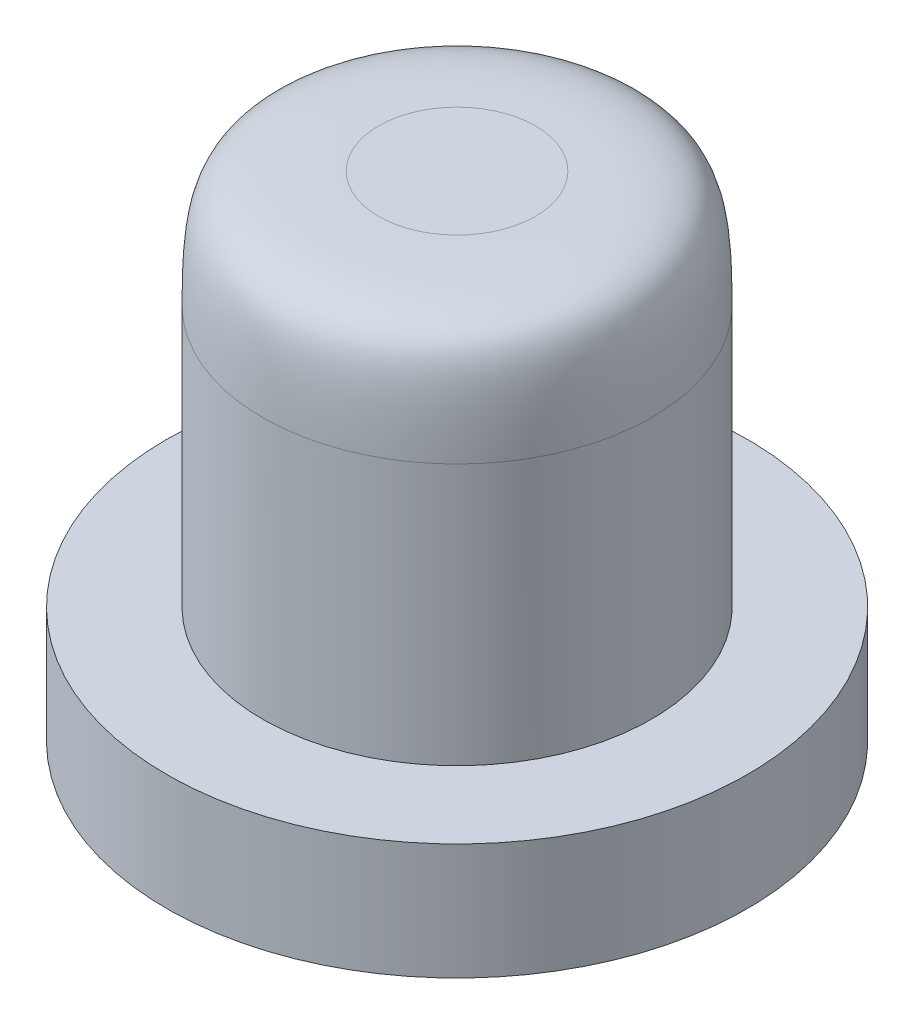
ISO-10303-21;
HEADER;
FILE_DESCRIPTION(('STEP AP214'),'2;1');
FILE_NAME('part.step','',(''),(''),'','','');
FILE_SCHEMA(('AUTOMOTIVE_DESIGN { 1 0 10303 214 1 1 1 1 }'));
ENDSEC;
DATA;
#1=APPLICATION_CONTEXT('core data for automotive mechanical design processes');
#2=APPLICATION_PROTOCOL_DEFINITION('international standard','automotive_design',2000,#1);
#3=PRODUCT_CONTEXT('',#1,'mechanical');
#4=PRODUCT('Part','Part','',(#3));
#5=PRODUCT_RELATED_PRODUCT_CATEGORY('part','',(#4));
#6=PRODUCT_DEFINITION_FORMATION('','',#4);
#7=PRODUCT_DEFINITION_CONTEXT('part definition',#1,'design');
#8=PRODUCT_DEFINITION('design','',#6,#7);
#9=PRODUCT_DEFINITION_SHAPE('','',#8);
#10=(LENGTH_UNIT() NAMED_UNIT(*) SI_UNIT(.MILLI.,.METRE.));
#11=(NAMED_UNIT(*) PLANE_ANGLE_UNIT() SI_UNIT($,.RADIAN.));
#12=(NAMED_UNIT(*) SI_UNIT($,.STERADIAN.) SOLID_ANGLE_UNIT());
#13=UNCERTAINTY_MEASURE_WITH_UNIT(LENGTH_MEASURE(1.E-05),#10,'distance_accuracy_value','');
#14=(GEOMETRIC_REPRESENTATION_CONTEXT(3) GLOBAL_UNCERTAINTY_ASSIGNED_CONTEXT((#13)) GLOBAL_UNIT_ASSIGNED_CONTEXT((#10,
#11,#12)) REPRESENTATION_CONTEXT('',''));
#15=CARTESIAN_POINT('',(0.,0.,0.));
#16=DIRECTION('',(0.,0.,1.));
#17=DIRECTION('',(1.,0.,0.));
#18=AXIS2_PLACEMENT_3D('',#15,#16,#17);
#19=CARTESIAN_POINT('',(0.,0.,0.));
#20=DIRECTION('',(0.,1.,0.));
#21=DIRECTION('',(-1.,0.,0.));
#22=AXIS2_PLACEMENT_3D('',#19,#20,#21);
#23=PLANE('',#22);
#24=CARTESIAN_POINT('',(0.,0.,0.));
#25=DIRECTION('',(0.,1.,0.));
#26=DIRECTION('',(-1.,0.,0.));
#27=AXIS2_PLACEMENT_3D('',#24,#25,#26);
#28=CIRCLE('',#27,5.);
#29=CARTESIAN_POINT('',(-5.,0.,0.));
#30=VERTEX_POINT('',#29);
#31=EDGE_CURVE('E53',#30,#30,#28,.T.);
#32=ORIENTED_EDGE('',*,*,#31,.F.);
#33=EDGE_LOOP('',(#32));
#34=FACE_BOUND('',#33,.T.);
#35=ADVANCED_FACE('F35',(#34),#23,.F.);
#36=CARTESIAN_POINT('',(0.,8.5,0.));
#37=DIRECTION('',(0.,1.,0.));
#38=DIRECTION('',(-1.,0.,0.));
#39=AXIS2_PLACEMENT_3D('',#36,#37,#38);
#40=CYLINDRICAL_SURFACE('',#39,5.);
#41=CARTESIAN_POINT('',(0.,2.,0.));
#42=DIRECTION('',(0.,1.,0.));
#43=DIRECTION('',(-1.,0.,0.));
#44=AXIS2_PLACEMENT_3D('',#41,#42,#43);
#45=CIRCLE('',#44,5.);
#46=CARTESIAN_POINT('',(-5.,2.,0.));
#47=VERTEX_POINT('',#46);
#48=EDGE_CURVE('E58',#47,#47,#45,.T.);
#49=ORIENTED_EDGE('',*,*,#48,.F.);
#50=EDGE_LOOP('',(#49));
#51=FACE_BOUND('',#50,.T.);
#52=ORIENTED_EDGE('',*,*,#31,.T.);
#53=EDGE_LOOP('',(#52));
#54=FACE_BOUND('',#53,.T.);
#55=ADVANCED_FACE('F108',(#51,#54),#40,.T.);
#56=CARTESIAN_POINT('',(5.,2.,0.));
#57=DIRECTION('',(0.,-1.,0.));
#58=DIRECTION('',(1.,0.,0.));
#59=AXIS2_PLACEMENT_3D('',#56,#57,#58);
#60=PLANE('',#59);
#61=CARTESIAN_POINT('',(0.,2.,0.));
#62=DIRECTION('',(0.,1.,0.));
#63=DIRECTION('',(-1.,0.,0.));
#64=AXIS2_PLACEMENT_3D('',#61,#62,#63);
#65=CIRCLE('',#64,3.35);
#66=CARTESIAN_POINT('',(-3.35,2.,0.));
#67=VERTEX_POINT('',#66);
#68=EDGE_CURVE('E63',#67,#67,#65,.T.);
#69=ORIENTED_EDGE('',*,*,#68,.F.);
#70=EDGE_LOOP('',(#69));
#71=FACE_BOUND('',#70,.T.);
#72=ORIENTED_EDGE('',*,*,#48,.T.);
#73=EDGE_LOOP('',(#72));
#74=FACE_BOUND('',#73,.T.);
#75=ADVANCED_FACE('F84',(#71,#74),#60,.F.);
#76=CARTESIAN_POINT('',(0.,8.5,0.));
#77=DIRECTION('',(0.,1.,0.));
#78=DIRECTION('',(-1.,0.,0.));
#79=AXIS2_PLACEMENT_3D('',#76,#77,#78);
#80=CYLINDRICAL_SURFACE('',#79,3.35);
#81=CARTESIAN_POINT('',(-3.35,6.5,0.));
#82=CARTESIAN_POINT('',(-3.35,6.5,0.438513934461704));
#83=CARTESIAN_POINT('',(-3.26280845149254,6.5,0.876855449652885));
#84=CARTESIAN_POINT('',(-2.92718441633308,6.5,1.68712354719323));
#85=CARTESIAN_POINT('',(-2.67888389367756,6.5,2.05873154027231));
#86=CARTESIAN_POINT('',(-2.05873154027231,6.5,2.67888389367756));
#87=CARTESIAN_POINT('',(-1.68712354719323,6.5,2.92718441633308));
#88=CARTESIAN_POINT('',(-0.876855449652879,6.5,3.26280845149254));
#89=CARTESIAN_POINT('',(-0.438513934461704,6.5,3.35));
#90=CARTESIAN_POINT('',(0.438513934461704,6.5,3.35));
#91=CARTESIAN_POINT('',(0.876855449652876,6.5,3.26280845149254));
#92=CARTESIAN_POINT('',(1.68712354719322,6.5,2.92718441633308));
#93=CARTESIAN_POINT('',(2.05873154027227,6.5,2.6788838936776));
#94=CARTESIAN_POINT('',(2.6788838936776,6.5,2.05873154027227));
#95=CARTESIAN_POINT('',(2.92718441633309,6.5,1.68712354719319));
#96=CARTESIAN_POINT('',(3.26280845149253,6.5,0.876855449652908));
#97=CARTESIAN_POINT('',(3.35,6.5,0.438513934461899));
#98=CARTESIAN_POINT('',(3.35,6.5,-0.438513934461899));
#99=CARTESIAN_POINT('',(3.26280845149252,6.5,-0.876855449652927));
#100=CARTESIAN_POINT('',(2.9271844163331,6.5,-1.68712354719317));
#101=CARTESIAN_POINT('',(2.67888389367764,6.5,-2.05873154027223));
#102=CARTESIAN_POINT('',(2.05873154027223,6.5,-2.67888389367763));
#103=CARTESIAN_POINT('',(1.68712354719298,6.5,-2.92718441633318));
#104=CARTESIAN_POINT('',(0.876855449653121,6.5,-3.26280845149244));
#105=CARTESIAN_POINT('',(0.438513934461706,6.5,-3.35));
#106=CARTESIAN_POINT('',(-0.438513934461702,6.5,-3.35));
#107=CARTESIAN_POINT('',(-0.876855449652902,6.5,-3.26280845149253));
#108=CARTESIAN_POINT('',(-1.68712354719321,6.5,-2.92718441633309));
#109=CARTESIAN_POINT('',(-2.05873154027225,6.5,-2.67888389367762));
#110=CARTESIAN_POINT('',(-2.67888389367761,6.5,-2.05873154027225));
#111=CARTESIAN_POINT('',(-2.9271844163331,6.5,-1.68712354719319));
#112=CARTESIAN_POINT('',(-3.26280845149253,6.5,-0.876855449652906));
#113=CARTESIAN_POINT('',(-3.35,6.5,-0.438513934461704));
#114=CARTESIAN_POINT('',(-3.35,6.5,0.));
#115=(BOUNDED_CURVE() B_SPLINE_CURVE(3,(#81,#82,#83,#84,#85,#86,#87,#88,#89,#90,#91,#92,#93,#94,
#95,#96,#97,#98,#99,#100,#101,#102,#103,#104,#105,#106,#107,#108,#109,#110,#111,#112,#113,#114),
.UNSPECIFIED.,.T.,.F.) B_SPLINE_CURVE_WITH_KNOTS((4,2,2,2,2,2,2,2,2,2,2,2,2,2,2,2,4),
(-3.14159265358979,-2.74889357189107,-2.35619449019234,-1.96349540849362,-1.5707963267949,
-1.17809724509617,-0.785398163397448,-0.392699081698724,0.,0.392699081698724,0.785398163397448,
1.17809724509617,1.5707963267949,1.96349540849362,2.35619449019234,2.74889357189107,
3.14159265358979),
.UNSPECIFIED.) CURVE() GEOMETRIC_REPRESENTATION_ITEM() RATIONAL_B_SPLINE_CURVE((1.,1.,1.,1.,1.,
1.,1.,1.,1.,1.,1.,1.,1.,1.,1.,1.,1.,1.,1.,1.,1.,1.,1.,1.,1.,1.,1.,1.,1.,1.,1.,1.,1.,1.)) REPRESENTATION_ITEM(''));
#116=CARTESIAN_POINT('',(-3.35,6.5,0.));
#117=VERTEX_POINT('',#116);
#118=EDGE_CURVE('E11',#117,#117,#115,.F.);
#119=ORIENTED_EDGE('',*,*,#118,.T.);
#120=EDGE_LOOP('',(#119));
#121=FACE_BOUND('',#120,.T.);
#122=ORIENTED_EDGE('',*,*,#68,.T.);
#123=EDGE_LOOP('',(#122));
#124=FACE_BOUND('',#123,.T.);
#125=ADVANCED_FACE('F80',(#121,#124),#80,.T.);
#126=CARTESIAN_POINT('',(3.35,8.5,0.));
#127=DIRECTION('',(0.,-1.,0.));
#128=DIRECTION('',(1.,0.,0.));
#129=AXIS2_PLACEMENT_3D('',#126,#127,#128);
#130=PLANE('',#129);
#131=CARTESIAN_POINT('',(-1.35,8.5,0.));
#132=CARTESIAN_POINT('',(-1.35,8.5,-0.17671457060397));
#133=CARTESIAN_POINT('',(-1.3148631073179,8.5,-0.353359658815345));
#134=CARTESIAN_POINT('',(-1.17961163046258,8.5,-0.679885608570394));
#135=CARTESIAN_POINT('',(-1.07955022581039,8.5,-0.829638083393303));
#136=CARTESIAN_POINT('',(-0.829638083393293,8.5,-1.07955022581038));
#137=CARTESIAN_POINT('',(-0.679885608570398,8.5,-1.17961163046258));
#138=CARTESIAN_POINT('',(-0.353359658815349,8.5,-1.31486310731789));
#139=CARTESIAN_POINT('',(-0.17671457060397,8.5,-1.35));
#140=CARTESIAN_POINT('',(0.176714570603971,8.5,-1.35));
#141=CARTESIAN_POINT('',(0.353359658815442,8.5,-1.31486310731786));
#142=CARTESIAN_POINT('',(0.6798856085703,8.5,-1.17961163046262));
#143=CARTESIAN_POINT('',(0.829638083393293,8.5,-1.07955022581038));
#144=CARTESIAN_POINT('',(1.07955022581039,8.5,-0.829638083393292));
#145=CARTESIAN_POINT('',(1.17961163046259,8.5,-0.679885608570383));
#146=CARTESIAN_POINT('',(1.31486310731789,8.5,-0.353359658815359));
#147=CARTESIAN_POINT('',(1.35,8.5,-0.176714570604049));
#148=CARTESIAN_POINT('',(1.35,8.5,0.176714570604049));
#149=CARTESIAN_POINT('',(1.31486310731789,8.5,0.35335965881534));
#150=CARTESIAN_POINT('',(1.17961163046258,8.5,0.679885608570403));
#151=CARTESIAN_POINT('',(1.07955022581037,8.5,0.829638083393302));
#152=CARTESIAN_POINT('',(0.829638083393312,8.5,1.07955022581038));
#153=CARTESIAN_POINT('',(0.679885608570405,8.5,1.17961163046258));
#154=CARTESIAN_POINT('',(0.353359658815336,8.5,1.31486310731789));
#155=CARTESIAN_POINT('',(0.17671457060397,8.5,1.35));
#156=CARTESIAN_POINT('',(-0.176714570603971,8.5,1.35));
#157=CARTESIAN_POINT('',(-0.353359658815338,8.5,1.31486310731789));
#158=CARTESIAN_POINT('',(-0.679885608570406,8.5,1.17961163046258));
#159=CARTESIAN_POINT('',(-0.829638083393313,8.5,1.07955022581037));
#160=CARTESIAN_POINT('',(-1.07955022581037,8.5,0.829638083393311));
#161=CARTESIAN_POINT('',(-1.17961163046258,8.5,0.679885608570398));
#162=CARTESIAN_POINT('',(-1.31486310731789,8.5,0.353359658815348));
#163=CARTESIAN_POINT('',(-1.35,8.5,0.17671457060397));
#164=CARTESIAN_POINT('',(-1.35,8.5,0.));
#165=(BOUNDED_CURVE() B_SPLINE_CURVE(3,(#131,#132,#133,#134,#135,#136,#137,#138,#139,#140,#141,
#142,#143,#144,#145,#146,#147,#148,#149,#150,#151,#152,#153,#154,#155,#156,#157,#158,#159,#160,
#161,#162,#163,#164),.UNSPECIFIED.,.T.,.F.) B_SPLINE_CURVE_WITH_KNOTS((4,2,2,2,2,2,2,2,2,2,2,2,
2,2,2,2,4),(-3.14159265358979,-2.74889357189107,-2.35619449019234,-1.96349540849362,
-1.5707963267949,-1.17809724509617,-0.785398163397448,-0.392699081698724,0.,0.392699081698724,
0.785398163397448,1.17809724509617,1.5707963267949,1.96349540849362,2.35619449019234,
2.74889357189107,3.14159265358979),
.UNSPECIFIED.) CURVE() GEOMETRIC_REPRESENTATION_ITEM() RATIONAL_B_SPLINE_CURVE((1.,1.,1.,1.,1.,
1.,1.,1.,1.,1.,1.,1.,1.,1.,1.,1.,1.,1.,1.,1.,1.,1.,1.,1.,1.,1.,1.,1.,1.,1.,1.,1.,1.,1.)) REPRESENTATION_ITEM(''));
#166=CARTESIAN_POINT('',(-1.35,8.5,0.));
#167=VERTEX_POINT('',#166);
#168=EDGE_CURVE('E48',#167,#167,#165,.F.);
#169=ORIENTED_EDGE('',*,*,#168,.T.);
#170=EDGE_LOOP('',(#169));
#171=FACE_BOUND('',#170,.T.);
#172=ADVANCED_FACE('F71',(#171),#130,.F.);
#173=CARTESIAN_POINT('',(-3.35,6.5,0.));
#174=CARTESIAN_POINT('',(-3.35,6.5,-0.438513934461704));
#175=CARTESIAN_POINT('',(-3.26280845149253,6.5,-0.876855449652906));
#176=CARTESIAN_POINT('',(-2.9271844163331,6.5,-1.68712354719319));
#177=CARTESIAN_POINT('',(-2.67888389367761,6.5,-2.05873154027225));
#178=CARTESIAN_POINT('',(-2.05873154027225,6.5,-2.67888389367762));
#179=CARTESIAN_POINT('',(-1.68712354719321,6.5,-2.92718441633309));
#180=CARTESIAN_POINT('',(-0.876855449652902,6.5,-3.26280845149253));
#181=CARTESIAN_POINT('',(-0.438513934461702,6.5,-3.35));
#182=CARTESIAN_POINT('',(0.438513934461706,6.5,-3.35));
#183=CARTESIAN_POINT('',(0.876855449653121,6.5,-3.26280845149244));
#184=CARTESIAN_POINT('',(1.68712354719298,6.5,-2.92718441633318));
#185=CARTESIAN_POINT('',(2.05873154027223,6.5,-2.67888389367763));
#186=CARTESIAN_POINT('',(2.67888389367764,6.5,-2.05873154027223));
#187=CARTESIAN_POINT('',(2.9271844163331,6.5,-1.68712354719317));
#188=CARTESIAN_POINT('',(3.26280845149252,6.5,-0.876855449652927));
#189=CARTESIAN_POINT('',(3.35,6.5,-0.438513934461899));
#190=CARTESIAN_POINT('',(3.35,6.5,0.438513934461899));
#191=CARTESIAN_POINT('',(3.26280845149253,6.5,0.876855449652908));
#192=CARTESIAN_POINT('',(2.92718441633309,6.5,1.68712354719319));
#193=CARTESIAN_POINT('',(2.6788838936776,6.5,2.05873154027227));
#194=CARTESIAN_POINT('',(2.05873154027227,6.5,2.6788838936776));
#195=CARTESIAN_POINT('',(1.68712354719322,6.5,2.92718441633308));
#196=CARTESIAN_POINT('',(0.876855449652876,6.5,3.26280845149254));
#197=CARTESIAN_POINT('',(0.438513934461704,6.5,3.35));
#198=CARTESIAN_POINT('',(-0.438513934461704,6.5,3.35));
#199=CARTESIAN_POINT('',(-0.876855449652879,6.5,3.26280845149254));
#200=CARTESIAN_POINT('',(-1.68712354719323,6.5,2.92718441633308));
#201=CARTESIAN_POINT('',(-2.05873154027231,6.5,2.67888389367756));
#202=CARTESIAN_POINT('',(-2.67888389367756,6.5,2.05873154027231));
#203=CARTESIAN_POINT('',(-2.92718441633308,6.5,1.68712354719323));
#204=CARTESIAN_POINT('',(-3.26280845149254,6.5,0.876855449652885));
#205=CARTESIAN_POINT('',(-3.35,6.5,0.438513934461704));
#206=CARTESIAN_POINT('',(-3.35,6.5,0.));
#207=CARTESIAN_POINT('',(-3.35,8.5,0.));
#208=CARTESIAN_POINT('',(-3.35,8.5,-0.438513934461703));
#209=CARTESIAN_POINT('',(-3.26280845149257,8.5,-0.876855449652925));
#210=CARTESIAN_POINT('',(-2.92718441633306,8.5,-1.68712354719317));
#211=CARTESIAN_POINT('',(-2.67888389367763,8.5,-2.05873154027231));
#212=CARTESIAN_POINT('',(-2.05873154027223,8.5,-2.67888389367756));
#213=CARTESIAN_POINT('',(-1.68712354719321,8.5,-2.92718441633305));
#214=CARTESIAN_POINT('',(-0.876855449652897,8.5,-3.26280845149256));
#215=CARTESIAN_POINT('',(-0.438513934461702,8.5,-3.35));
#216=CARTESIAN_POINT('',(0.438513934461706,8.5,-3.35));
#217=CARTESIAN_POINT('',(0.876855449653142,8.5,-3.26280845149249));
#218=CARTESIAN_POINT('',(1.68712354719296,8.5,-2.92718441633313));
#219=CARTESIAN_POINT('',(2.05873154027223,8.5,-2.67888389367763));
#220=CARTESIAN_POINT('',(2.67888389367764,8.5,-2.05873154027223));
#221=CARTESIAN_POINT('',(2.92718441633307,8.5,-1.68712354719318));
#222=CARTESIAN_POINT('',(3.26280845149255,8.5,-0.876855449652922));
#223=CARTESIAN_POINT('',(3.35,8.5,-0.438513934461898));
#224=CARTESIAN_POINT('',(3.35,8.5,0.438513934461898));
#225=CARTESIAN_POINT('',(3.26280845149255,8.5,0.876855449652922));
#226=CARTESIAN_POINT('',(2.92718441633307,8.5,1.68712354719318));
#227=CARTESIAN_POINT('',(2.6788838936776,8.5,2.05873154027227));
#228=CARTESIAN_POINT('',(2.05873154027227,8.5,2.6788838936776));
#229=CARTESIAN_POINT('',(1.68712354719321,8.5,2.92718441633305));
#230=CARTESIAN_POINT('',(0.87685544965289,8.5,3.26280845149257));
#231=CARTESIAN_POINT('',(0.438513934461704,8.5,3.35));
#232=CARTESIAN_POINT('',(-0.438513934461704,8.5,3.35));
#233=CARTESIAN_POINT('',(-0.876855449652874,8.5,3.26280845149253));
#234=CARTESIAN_POINT('',(-1.68712354719323,8.5,2.92718441633309));
#235=CARTESIAN_POINT('',(-2.05873154027235,8.5,2.67888389367756));
#236=CARTESIAN_POINT('',(-2.67888389367752,8.5,2.05873154027231));
#237=CARTESIAN_POINT('',(-2.92718441633305,8.5,1.68712354719321));
#238=CARTESIAN_POINT('',(-3.26280845149256,8.5,0.876855449652896));
#239=CARTESIAN_POINT('',(-3.35,8.5,0.438513934461704));
#240=CARTESIAN_POINT('',(-3.35,8.5,0.));
#241=CARTESIAN_POINT('',(-1.35,8.5,0.));
#242=CARTESIAN_POINT('',(-1.35,8.5,-0.17671457060397));
#243=CARTESIAN_POINT('',(-1.3148631073179,8.5,-0.353359658815345));
#244=CARTESIAN_POINT('',(-1.17961163046258,8.5,-0.679885608570394));
#245=CARTESIAN_POINT('',(-1.07955022581039,8.5,-0.829638083393303));
#246=CARTESIAN_POINT('',(-0.829638083393293,8.5,-1.07955022581038));
#247=CARTESIAN_POINT('',(-0.679885608570398,8.5,-1.17961163046258));
#248=CARTESIAN_POINT('',(-0.353359658815349,8.5,-1.31486310731789));
#249=CARTESIAN_POINT('',(-0.17671457060397,8.5,-1.35));
#250=CARTESIAN_POINT('',(0.176714570603971,8.5,-1.35));
#251=CARTESIAN_POINT('',(0.353359658815442,8.5,-1.31486310731786));
#252=CARTESIAN_POINT('',(0.6798856085703,8.5,-1.17961163046262));
#253=CARTESIAN_POINT('',(0.829638083393293,8.5,-1.07955022581038));
#254=CARTESIAN_POINT('',(1.07955022581039,8.5,-0.829638083393292));
#255=CARTESIAN_POINT('',(1.17961163046259,8.5,-0.679885608570383));
#256=CARTESIAN_POINT('',(1.31486310731789,8.5,-0.353359658815359));
#257=CARTESIAN_POINT('',(1.35,8.5,-0.176714570604049));
#258=CARTESIAN_POINT('',(1.35,8.5,0.176714570604049));
#259=CARTESIAN_POINT('',(1.31486310731789,8.5,0.35335965881534));
#260=CARTESIAN_POINT('',(1.17961163046258,8.5,0.679885608570403));
#261=CARTESIAN_POINT('',(1.07955022581037,8.5,0.829638083393302));
#262=CARTESIAN_POINT('',(0.829638083393312,8.5,1.07955022581038));
#263=CARTESIAN_POINT('',(0.679885608570405,8.5,1.17961163046258));
#264=CARTESIAN_POINT('',(0.353359658815336,8.5,1.31486310731789));
#265=CARTESIAN_POINT('',(0.17671457060397,8.5,1.35));
#266=CARTESIAN_POINT('',(-0.176714570603971,8.5,1.35));
#267=CARTESIAN_POINT('',(-0.353359658815338,8.5,1.31486310731789));
#268=CARTESIAN_POINT('',(-0.679885608570406,8.5,1.17961163046258));
#269=CARTESIAN_POINT('',(-0.829638083393313,8.5,1.07955022581037));
#270=CARTESIAN_POINT('',(-1.07955022581037,8.5,0.829638083393311));
#271=CARTESIAN_POINT('',(-1.17961163046258,8.5,0.679885608570398));
#272=CARTESIAN_POINT('',(-1.31486310731789,8.5,0.353359658815348));
#273=CARTESIAN_POINT('',(-1.35,8.5,0.17671457060397));
#274=CARTESIAN_POINT('',(-1.35,8.5,0.));
#275=(BOUNDED_SURFACE() B_SPLINE_SURFACE(2,3,((#173,#174,#175,#176,#177,#178,#179,#180,#181,
#182,#183,#184,#185,#186,#187,#188,#189,#190,#191,#192,#193,#194,#195,#196,#197,#198,#199,#200,
#201,#202,#203,#204,#205,#206),(#207,#208,#209,#210,#211,#212,#213,#214,#215,#216,#217,#218,
#219,#220,#221,#222,#223,#224,#225,#226,#227,#228,#229,#230,#231,#232,#233,#234,#235,#236,#237,
#238,#239,#240),(#241,#242,#243,#244,#245,#246,#247,#248,#249,#250,#251,#252,#253,#254,#255,
#256,#257,#258,#259,#260,#261,#262,#263,#264,#265,#266,#267,#268,#269,#270,#271,#272,#273,
#274)),.UNSPECIFIED.,.F.,.T.,.F.) B_SPLINE_SURFACE_WITH_KNOTS((3,3),(4,2,2,2,2,2,2,2,2,2,2,2,2,
2,2,2,4),(0.,1.),(-3.14159265358979,-2.74889357189107,-2.35619449019234,-1.96349540849362,
-1.5707963267949,-1.17809724509617,-0.785398163397448,-0.392699081698724,0.,0.392699081698724,
0.785398163397448,1.17809724509617,1.5707963267949,1.96349540849362,2.35619449019234,
2.74889357189107,3.14159265358979),
.UNSPECIFIED.) GEOMETRIC_REPRESENTATION_ITEM() RATIONAL_B_SPLINE_SURFACE(((1.,1.,1.,1.,1.,1.,1.,
1.,1.,1.,1.,1.,1.,1.,1.,1.,1.,1.,1.,1.,1.,1.,1.,1.,1.,1.,1.,1.,1.,1.,1.,1.,1.,1.),
(2.33333333333333,2.33333333333333,2.33333333333333,2.33333333333333,2.33333333333333,
2.33333333333333,2.33333333333333,2.33333333333333,2.33333333333333,2.33333333333333,
2.33333333333333,2.33333333333333,2.33333333333333,2.33333333333333,2.33333333333333,
2.33333333333333,2.33333333333333,2.33333333333333,2.33333333333333,2.33333333333333,
2.33333333333333,2.33333333333333,2.33333333333333,2.33333333333333,2.33333333333333,
2.33333333333333,2.33333333333333,2.33333333333333,2.33333333333333,2.33333333333333,
2.33333333333333,2.33333333333333,2.33333333333333,2.33333333333333),(1.,1.,1.,1.,1.,1.,1.,1.,
1.,1.,1.,1.,1.,1.,1.,1.,1.,1.,1.,1.,1.,1.,1.,1.,1.,1.,1.,1.,1.,1.,1.,1.,1.,1.))) REPRESENTATION_ITEM('') SURFACE());
#276=ORIENTED_EDGE('',*,*,#118,.F.);
#277=EDGE_LOOP('',(#276));
#278=FACE_BOUND('',#277,.T.);
#279=ORIENTED_EDGE('',*,*,#168,.F.);
#280=EDGE_LOOP('',(#279));
#281=FACE_BOUND('',#280,.T.);
#282=ADVANCED_FACE('F38',(#278,#281),#275,.T.);
#283=CLOSED_SHELL('',(#35,#55,#75,#125,#172,#282));
#284=MANIFOLD_SOLID_BREP('B2',#283);
#285=ADVANCED_BREP_SHAPE_REPRESENTATION('',(#18,#284),#14);
#286=SHAPE_DEFINITION_REPRESENTATION(#9,#285);
ENDSEC;
END-ISO-10303-21;
